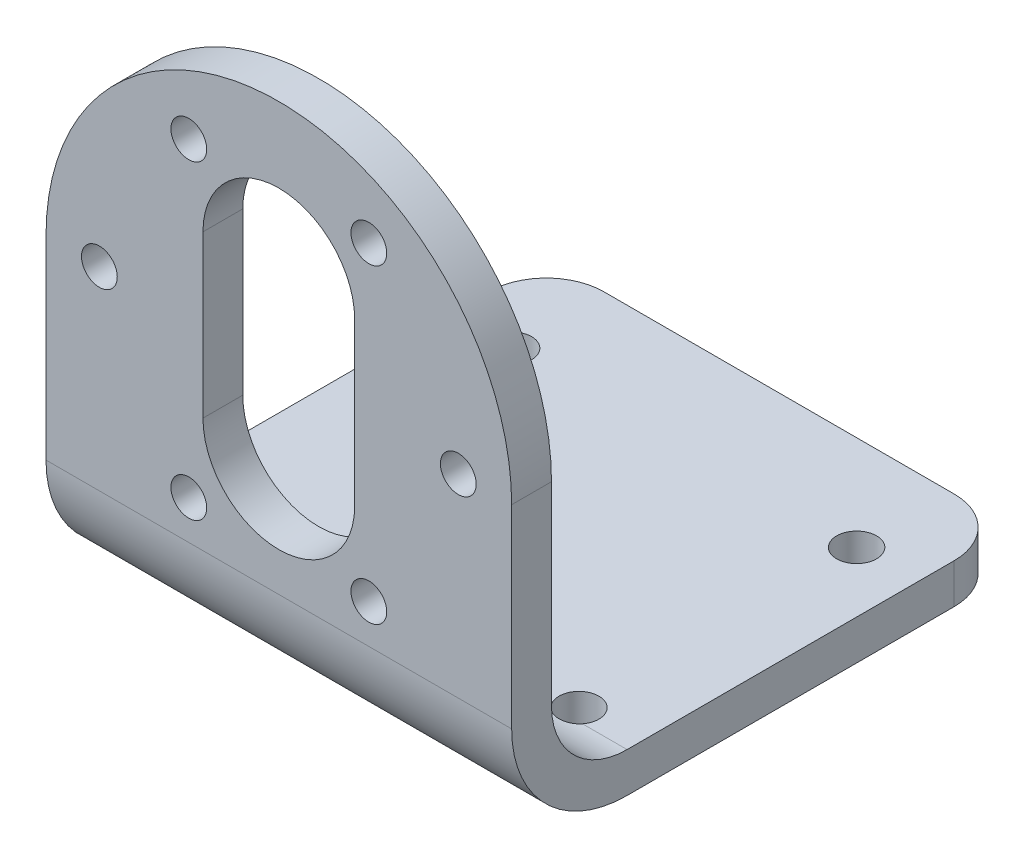
ISO-10303-21;
HEADER;
FILE_DESCRIPTION(('STEP AP214'),'2;1');
FILE_NAME('part.step','',(''),(''),'','','');
FILE_SCHEMA(('AUTOMOTIVE_DESIGN { 1 0 10303 214 1 1 1 1 }'));
ENDSEC;
DATA;
#1=APPLICATION_CONTEXT('core data for automotive mechanical design processes');
#2=APPLICATION_PROTOCOL_DEFINITION('international standard','automotive_design',2000,#1);
#3=PRODUCT_CONTEXT('',#1,'mechanical');
#4=PRODUCT('Part','Part','',(#3));
#5=PRODUCT_RELATED_PRODUCT_CATEGORY('part','',(#4));
#6=PRODUCT_DEFINITION_FORMATION('','',#4);
#7=PRODUCT_DEFINITION_CONTEXT('part definition',#1,'design');
#8=PRODUCT_DEFINITION('design','',#6,#7);
#9=PRODUCT_DEFINITION_SHAPE('','',#8);
#10=(LENGTH_UNIT() NAMED_UNIT(*) SI_UNIT(.MILLI.,.METRE.));
#11=(NAMED_UNIT(*) PLANE_ANGLE_UNIT() SI_UNIT($,.RADIAN.));
#12=(NAMED_UNIT(*) SI_UNIT($,.STERADIAN.) SOLID_ANGLE_UNIT());
#13=UNCERTAINTY_MEASURE_WITH_UNIT(LENGTH_MEASURE(1.E-05),#10,'distance_accuracy_value','');
#14=(GEOMETRIC_REPRESENTATION_CONTEXT(3) GLOBAL_UNCERTAINTY_ASSIGNED_CONTEXT((#13)) GLOBAL_UNIT_ASSIGNED_CONTEXT((#10,
#11,#12)) REPRESENTATION_CONTEXT('',''));
#15=CARTESIAN_POINT('',(0.,0.,0.));
#16=DIRECTION('',(0.,0.,1.));
#17=DIRECTION('',(1.,0.,0.));
#18=AXIS2_PLACEMENT_3D('',#15,#16,#17);
#19=CARTESIAN_POINT('',(-47.1412127925836,47.,50.783023222912));
#20=DIRECTION('',(0.,0.,-1.));
#21=DIRECTION('',(-1.,0.,0.));
#22=AXIS2_PLACEMENT_3D('',#19,#20,#21);
#23=PLANE('',#22);
#24=CARTESIAN_POINT('',(-19.1662127925836,13.3727697016443,50.783023222912));
#25=DIRECTION('',(0.,0.,1.));
#26=DIRECTION('',(1.,0.,0.));
#27=AXIS2_PLACEMENT_3D('',#24,#25,#26);
#28=CIRCLE('',#27,1.55);
#29=CARTESIAN_POINT('',(-17.6162127925836,13.3727697016443,50.783023222912));
#30=VERTEX_POINT('',#29);
#31=EDGE_CURVE('E434',#30,#30,#28,.F.);
#32=ORIENTED_EDGE('',*,*,#31,.T.);
#33=EDGE_LOOP('',(#32));
#34=FACE_BOUND('',#33,.T.);
#35=CARTESIAN_POINT('',(-42.5162127925836,26.825,50.783023222912));
#36=DIRECTION('',(0.,0.,1.));
#37=DIRECTION('',(1.,0.,0.));
#38=AXIS2_PLACEMENT_3D('',#35,#36,#37);
#39=CIRCLE('',#38,1.54999999999999);
#40=CARTESIAN_POINT('',(-40.9662127925836,26.825,50.783023222912));
#41=VERTEX_POINT('',#40);
#42=EDGE_CURVE('E431',#41,#41,#39,.T.);
#43=ORIENTED_EDGE('',*,*,#42,.F.);
#44=EDGE_LOOP('',(#43));
#45=FACE_BOUND('',#44,.T.);
#46=CARTESIAN_POINT('',(-19.1662127925836,40.2772302983557,50.783023222912));
#47=DIRECTION('',(0.,0.,1.));
#48=DIRECTION('',(1.,0.,0.));
#49=AXIS2_PLACEMENT_3D('',#46,#47,#48);
#50=CIRCLE('',#49,1.55);
#51=CARTESIAN_POINT('',(-17.6162127925836,40.2772302983557,50.783023222912));
#52=VERTEX_POINT('',#51);
#53=EDGE_CURVE('E426',#52,#52,#50,.T.);
#54=ORIENTED_EDGE('',*,*,#53,.F.);
#55=EDGE_LOOP('',(#54));
#56=FACE_BOUND('',#55,.T.);
#57=CARTESIAN_POINT('',(-34.7662127925836,13.3727697016443,50.783023222912));
#58=DIRECTION('',(0.,0.,1.));
#59=DIRECTION('',(1.,0.,0.));
#60=AXIS2_PLACEMENT_3D('',#57,#58,#59);
#61=CIRCLE('',#60,1.55);
#62=CARTESIAN_POINT('',(-33.2162127925836,13.3727697016443,50.783023222912));
#63=VERTEX_POINT('',#62);
#64=EDGE_CURVE('E264',#63,#63,#61,.F.);
#65=ORIENTED_EDGE('',*,*,#64,.T.);
#66=EDGE_LOOP('',(#65));
#67=FACE_BOUND('',#66,.T.);
#68=CARTESIAN_POINT('',(-26.9662127925836,19.945,50.783023222912));
#69=DIRECTION('',(0.,0.,1.));
#70=DIRECTION('',(1.,0.,0.));
#71=AXIS2_PLACEMENT_3D('',#68,#69,#70);
#72=CIRCLE('',#71,6.575);
#73=CARTESIAN_POINT('',(-33.5412127925836,19.945,50.783023222912));
#74=VERTEX_POINT('',#73);
#75=CARTESIAN_POINT('',(-20.3912127925836,19.945,50.783023222912));
#76=VERTEX_POINT('',#75);
#77=EDGE_CURVE('E171',#74,#76,#72,.T.);
#78=ORIENTED_EDGE('',*,*,#77,.F.);
#79=DIRECTION('',(0.,-1.,0.));
#80=VECTOR('',#79,1.);
#81=CARTESIAN_POINT('',(-33.5412127925836,0.,50.783023222912));
#82=LINE('',#81,#80);
#83=CARTESIAN_POINT('',(-33.5412127925836,33.925,50.783023222912));
#84=VERTEX_POINT('',#83);
#85=EDGE_CURVE('E49',#84,#74,#82,.T.);
#86=ORIENTED_EDGE('',*,*,#85,.F.);
#87=CARTESIAN_POINT('',(-26.9662127925836,33.925,50.783023222912));
#88=DIRECTION('',(0.,0.,1.));
#89=DIRECTION('',(1.,0.,0.));
#90=AXIS2_PLACEMENT_3D('',#87,#88,#89);
#91=CIRCLE('',#90,6.57500000000001);
#92=CARTESIAN_POINT('',(-20.3912127925836,33.925,50.783023222912));
#93=VERTEX_POINT('',#92);
#94=EDGE_CURVE('E177',#93,#84,#91,.T.);
#95=ORIENTED_EDGE('',*,*,#94,.F.);
#96=DIRECTION('',(0.,-1.,0.));
#97=VECTOR('',#96,1.);
#98=CARTESIAN_POINT('',(-20.3912127925836,0.,50.783023222912));
#99=LINE('',#98,#97);
#100=EDGE_CURVE('E162',#93,#76,#99,.T.);
#101=ORIENTED_EDGE('',*,*,#100,.T.);
#102=EDGE_LOOP('',(#78,#86,#95,#101));
#103=FACE_BOUND('',#102,.T.);
#104=DIRECTION('',(0.,-1.,0.));
#105=VECTOR('',#104,1.);
#106=CARTESIAN_POINT('',(-47.1412127925836,47.,50.783023222912));
#107=LINE('',#106,#105);
#108=CARTESIAN_POINT('',(-47.1412127925836,26.825,50.783023222912));
#109=VERTEX_POINT('',#108);
#110=CARTESIAN_POINT('',(-47.1412127925836,10.,50.783023222912));
#111=VERTEX_POINT('',#110);
#112=EDGE_CURVE('E322',#109,#111,#107,.T.);
#113=ORIENTED_EDGE('',*,*,#112,.T.);
#114=DIRECTION('',(1.,0.,0.));
#115=VECTOR('',#114,1.);
#116=CARTESIAN_POINT('',(-47.1412127925836,10.,50.783023222912));
#117=LINE('',#116,#115);
#118=CARTESIAN_POINT('',(-6.79121279258359,10.,50.783023222912));
#119=VERTEX_POINT('',#118);
#120=EDGE_CURVE('E317',#111,#119,#117,.T.);
#121=ORIENTED_EDGE('',*,*,#120,.T.);
#122=DIRECTION('',(0.,-1.,0.));
#123=VECTOR('',#122,1.);
#124=CARTESIAN_POINT('',(-6.79121279258359,47.,50.783023222912));
#125=LINE('',#124,#123);
#126=CARTESIAN_POINT('',(-6.79121279258359,26.825,50.783023222912));
#127=VERTEX_POINT('',#126);
#128=EDGE_CURVE('E325',#127,#119,#125,.T.);
#129=ORIENTED_EDGE('',*,*,#128,.F.);
#130=CARTESIAN_POINT('',(-26.9662127925836,26.825,50.783023222912));
#131=DIRECTION('',(0.,0.,1.));
#132=DIRECTION('',(1.,0.,0.));
#133=AXIS2_PLACEMENT_3D('',#130,#131,#132);
#134=CIRCLE('',#133,20.175);
#135=EDGE_CURVE('E339',#127,#109,#134,.T.);
#136=ORIENTED_EDGE('',*,*,#135,.T.);
#137=EDGE_LOOP('',(#113,#121,#129,#136));
#138=FACE_BOUND('',#137,.T.);
#139=CARTESIAN_POINT('',(-34.7662127925836,40.2772302983557,50.783023222912));
#140=DIRECTION('',(0.,0.,1.));
#141=DIRECTION('',(1.,0.,0.));
#142=AXIS2_PLACEMENT_3D('',#139,#140,#141);
#143=CIRCLE('',#142,1.55);
#144=CARTESIAN_POINT('',(-33.2162127925836,40.2772302983557,50.783023222912));
#145=VERTEX_POINT('',#144);
#146=EDGE_CURVE('E428',#145,#145,#143,.T.);
#147=ORIENTED_EDGE('',*,*,#146,.F.);
#148=EDGE_LOOP('',(#147));
#149=FACE_BOUND('',#148,.T.);
#150=CARTESIAN_POINT('',(-11.4162127925836,26.825,50.783023222912));
#151=DIRECTION('',(0.,0.,1.));
#152=DIRECTION('',(1.,0.,0.));
#153=AXIS2_PLACEMENT_3D('',#150,#151,#152);
#154=CIRCLE('',#153,1.55);
#155=CARTESIAN_POINT('',(-9.8662127925836,26.825,50.783023222912));
#156=VERTEX_POINT('',#155);
#157=EDGE_CURVE('E437',#156,#156,#154,.T.);
#158=ORIENTED_EDGE('',*,*,#157,.F.);
#159=EDGE_LOOP('',(#158));
#160=FACE_BOUND('',#159,.T.);
#161=ADVANCED_FACE('F32',(#34,#45,#56,#67,#103,#138,#149,#160),#23,.F.);
#162=CARTESIAN_POINT('',(54.8587872074164,0.,47.3330232229119));
#163=DIRECTION('',(0.,0.,1.));
#164=DIRECTION('',(1.,0.,0.));
#165=AXIS2_PLACEMENT_3D('',#162,#163,#164);
#166=PLANE('',#165);
#167=CARTESIAN_POINT('',(-19.1662127925836,13.3727697016443,47.333023222912));
#168=DIRECTION('',(0.,0.,1.));
#169=DIRECTION('',(1.,0.,0.));
#170=AXIS2_PLACEMENT_3D('',#167,#168,#169);
#171=CIRCLE('',#170,1.55);
#172=CARTESIAN_POINT('',(-17.6162127925836,13.3727697016443,47.333023222912));
#173=VERTEX_POINT('',#172);
#174=EDGE_CURVE('E36',#173,#173,#171,.F.);
#175=ORIENTED_EDGE('',*,*,#174,.F.);
#176=EDGE_LOOP('',(#175));
#177=FACE_BOUND('',#176,.T.);
#178=CARTESIAN_POINT('',(-42.5162127925836,26.825,47.333023222912));
#179=DIRECTION('',(0.,0.,1.));
#180=DIRECTION('',(1.,0.,0.));
#181=AXIS2_PLACEMENT_3D('',#178,#179,#180);
#182=CIRCLE('',#181,1.54999999999999);
#183=CARTESIAN_POINT('',(-40.9662127925836,26.825,47.333023222912));
#184=VERTEX_POINT('',#183);
#185=EDGE_CURVE('E237',#184,#184,#182,.T.);
#186=ORIENTED_EDGE('',*,*,#185,.T.);
#187=EDGE_LOOP('',(#186));
#188=FACE_BOUND('',#187,.T.);
#189=CARTESIAN_POINT('',(-19.1662127925836,40.2772302983557,47.333023222912));
#190=DIRECTION('',(0.,0.,1.));
#191=DIRECTION('',(1.,0.,0.));
#192=AXIS2_PLACEMENT_3D('',#189,#190,#191);
#193=CIRCLE('',#192,1.55);
#194=CARTESIAN_POINT('',(-17.6162127925836,40.2772302983557,47.333023222912));
#195=VERTEX_POINT('',#194);
#196=EDGE_CURVE('E241',#195,#195,#193,.T.);
#197=ORIENTED_EDGE('',*,*,#196,.T.);
#198=EDGE_LOOP('',(#197));
#199=FACE_BOUND('',#198,.T.);
#200=CARTESIAN_POINT('',(-34.7662127925836,13.3727697016443,47.333023222912));
#201=DIRECTION('',(0.,0.,1.));
#202=DIRECTION('',(1.,0.,0.));
#203=AXIS2_PLACEMENT_3D('',#200,#201,#202);
#204=CIRCLE('',#203,1.55);
#205=CARTESIAN_POINT('',(-33.2162127925836,13.3727697016443,47.333023222912));
#206=VERTEX_POINT('',#205);
#207=EDGE_CURVE('E245',#206,#206,#204,.F.);
#208=ORIENTED_EDGE('',*,*,#207,.F.);
#209=EDGE_LOOP('',(#208));
#210=FACE_BOUND('',#209,.T.);
#211=CARTESIAN_POINT('',(-26.9662127925836,33.925,47.333023222912));
#212=DIRECTION('',(0.,0.,1.));
#213=DIRECTION('',(1.,0.,0.));
#214=AXIS2_PLACEMENT_3D('',#211,#212,#213);
#215=CIRCLE('',#214,6.57500000000001);
#216=CARTESIAN_POINT('',(-20.3912127925836,33.925,47.333023222912));
#217=VERTEX_POINT('',#216);
#218=CARTESIAN_POINT('',(-33.5412127925836,33.925,47.333023222912));
#219=VERTEX_POINT('',#218);
#220=EDGE_CURVE('E41',#217,#219,#215,.T.);
#221=ORIENTED_EDGE('',*,*,#220,.T.);
#222=DIRECTION('',(0.,-1.,0.));
#223=VECTOR('',#222,1.);
#224=CARTESIAN_POINT('',(-33.5412127925836,0.,47.333023222912));
#225=LINE('',#224,#223);
#226=CARTESIAN_POINT('',(-33.5412127925836,19.945,47.333023222912));
#227=VERTEX_POINT('',#226);
#228=EDGE_CURVE('E11',#219,#227,#225,.T.);
#229=ORIENTED_EDGE('',*,*,#228,.T.);
#230=CARTESIAN_POINT('',(-26.9662127925836,19.945,47.333023222912));
#231=DIRECTION('',(0.,0.,1.));
#232=DIRECTION('',(1.,0.,0.));
#233=AXIS2_PLACEMENT_3D('',#230,#231,#232);
#234=CIRCLE('',#233,6.575);
#235=CARTESIAN_POINT('',(-20.3912127925836,19.945,47.333023222912));
#236=VERTEX_POINT('',#235);
#237=EDGE_CURVE('E268',#227,#236,#234,.T.);
#238=ORIENTED_EDGE('',*,*,#237,.T.);
#239=DIRECTION('',(0.,-1.,0.));
#240=VECTOR('',#239,1.);
#241=CARTESIAN_POINT('',(-20.3912127925836,0.,47.333023222912));
#242=LINE('',#241,#240);
#243=EDGE_CURVE('E165',#217,#236,#242,.T.);
#244=ORIENTED_EDGE('',*,*,#243,.F.);
#245=EDGE_LOOP('',(#221,#229,#238,#244));
#246=FACE_BOUND('',#245,.T.);
#247=DIRECTION('',(-1.,0.,0.));
#248=VECTOR('',#247,1.);
#249=CARTESIAN_POINT('',(54.8587872074164,10.,47.3330232229119));
#250=LINE('',#249,#248);
#251=CARTESIAN_POINT('',(-6.79121279258359,10.,47.333023222912));
#252=VERTEX_POINT('',#251);
#253=CARTESIAN_POINT('',(-47.1412127925836,10.,47.333023222912));
#254=VERTEX_POINT('',#253);
#255=EDGE_CURVE('E250',#252,#254,#250,.T.);
#256=ORIENTED_EDGE('',*,*,#255,.T.);
#257=DIRECTION('',(0.,1.,0.));
#258=VECTOR('',#257,1.);
#259=CARTESIAN_POINT('',(-47.1412127925836,0.,47.333023222912));
#260=LINE('',#259,#258);
#261=CARTESIAN_POINT('',(-47.1412127925836,26.825,47.333023222912));
#262=VERTEX_POINT('',#261);
#263=EDGE_CURVE('E357',#254,#262,#260,.T.);
#264=ORIENTED_EDGE('',*,*,#263,.T.);
#265=CARTESIAN_POINT('',(-26.9662127925836,26.825,47.333023222912));
#266=DIRECTION('',(0.,0.,1.));
#267=DIRECTION('',(1.,0.,0.));
#268=AXIS2_PLACEMENT_3D('',#265,#266,#267);
#269=CIRCLE('',#268,20.175);
#270=CARTESIAN_POINT('',(-6.79121279258359,26.825,47.333023222912));
#271=VERTEX_POINT('',#270);
#272=EDGE_CURVE('E306',#262,#271,#269,.F.);
#273=ORIENTED_EDGE('',*,*,#272,.T.);
#274=DIRECTION('',(0.,1.,0.));
#275=VECTOR('',#274,1.);
#276=CARTESIAN_POINT('',(-6.7912127925836,47.,47.333023222912));
#277=LINE('',#276,#275);
#278=EDGE_CURVE('E345',#252,#271,#277,.T.);
#279=ORIENTED_EDGE('',*,*,#278,.F.);
#280=EDGE_LOOP('',(#256,#264,#273,#279));
#281=FACE_BOUND('',#280,.T.);
#282=CARTESIAN_POINT('',(-34.7662127925836,40.2772302983557,47.333023222912));
#283=DIRECTION('',(0.,0.,1.));
#284=DIRECTION('',(1.,0.,0.));
#285=AXIS2_PLACEMENT_3D('',#282,#283,#284);
#286=CIRCLE('',#285,1.55);
#287=CARTESIAN_POINT('',(-33.2162127925836,40.2772302983557,47.333023222912));
#288=VERTEX_POINT('',#287);
#289=EDGE_CURVE('E255',#288,#288,#286,.T.);
#290=ORIENTED_EDGE('',*,*,#289,.T.);
#291=EDGE_LOOP('',(#290));
#292=FACE_BOUND('',#291,.T.);
#293=CARTESIAN_POINT('',(-11.4162127925836,26.825,47.333023222912));
#294=DIRECTION('',(0.,0.,1.));
#295=DIRECTION('',(1.,0.,0.));
#296=AXIS2_PLACEMENT_3D('',#293,#294,#295);
#297=CIRCLE('',#296,1.55);
#298=CARTESIAN_POINT('',(-9.8662127925836,26.825,47.333023222912));
#299=VERTEX_POINT('',#298);
#300=EDGE_CURVE('E258',#299,#299,#297,.T.);
#301=ORIENTED_EDGE('',*,*,#300,.T.);
#302=EDGE_LOOP('',(#301));
#303=FACE_BOUND('',#302,.T.);
#304=ADVANCED_FACE('F220',(#177,#188,#199,#210,#246,#281,#292,#303),#166,.F.);
#305=CARTESIAN_POINT('',(-47.1412127925836,10.,40.783023222912));
#306=DIRECTION('',(1.,0.,0.));
#307=DIRECTION('',(0.,0.,-1.));
#308=AXIS2_PLACEMENT_3D('',#305,#306,#307);
#309=CYLINDRICAL_SURFACE('',#308,10.);
#310=DIRECTION('',(1.,0.,0.));
#311=VECTOR('',#310,1.);
#312=CARTESIAN_POINT('',(0.,0.,40.783023222912));
#313=LINE('',#312,#311);
#314=CARTESIAN_POINT('',(-43.2784362563963,0.,40.783023222912));
#315=VERTEX_POINT('',#314);
#316=CARTESIAN_POINT('',(-47.1412127925836,0.,40.783023222912));
#317=VERTEX_POINT('',#316);
#318=EDGE_CURVE('E314',#315,#317,#313,.F.);
#319=ORIENTED_EDGE('',*,*,#318,.F.);
#320=CARTESIAN_POINT('',(-43.2784362563963,0.,40.783023222912));
#321=CARTESIAN_POINT('',(-43.2486359399709,-4.4349836473621E-07,40.8214603242163));
#322=CARTESIAN_POINT('',(-43.2172287872784,0.000221662332903279,40.8586212397988));
#323=CARTESIAN_POINT('',(-43.1514043101819,0.0010186956629008,40.9301644796071));
#324=CARTESIAN_POINT('',(-43.1169872222953,0.00159359546079015,40.9645470217466));
#325=CARTESIAN_POINT('',(-43.0096338534374,0.00370689110784972,41.0630910128974));
#326=CARTESIAN_POINT('',(-42.9324984911893,0.0056344754400285,41.1227736432645));
#327=CARTESIAN_POINT('',(-42.7693296609276,0.00977993356184888,41.228345263273));
#328=CARTESIAN_POINT('',(-42.6832930344563,0.0119979104668324,41.2742293340198));
#329=CARTESIAN_POINT('',(-42.5047417406216,0.0160643864272017,41.3509225745123));
#330=CARTESIAN_POINT('',(-42.4122283105362,0.017912955792662,41.3817346145671));
#331=CARTESIAN_POINT('',(-42.2232265987625,0.0207581801391745,41.4274329016619));
#332=CARTESIAN_POINT('',(-42.12673395157,0.0217538719032161,41.4423011469684));
#333=CARTESIAN_POINT('',(-41.9326057116994,0.0226429764720122,41.4556247462691));
#334=CARTESIAN_POINT('',(-41.8349700052027,0.0225362785590523,41.4540784516805));
#335=CARTESIAN_POINT('',(-41.6415763854825,0.021247958445125,41.4346366721685));
#336=CARTESIAN_POINT('',(-41.545814678288,0.0200688027684255,41.4167787017401));
#337=CARTESIAN_POINT('',(-41.3586275956189,0.0169319205563948,41.3652693387677));
#338=CARTESIAN_POINT('',(-41.2672030897992,0.0149740386105347,41.3316147934571));
#339=CARTESIAN_POINT('',(-41.0911541003926,0.0107972095030289,41.24941231941));
#340=CARTESIAN_POINT('',(-41.0065411024623,0.0085778363148311,41.2008398734209));
#341=CARTESIAN_POINT('',(-40.8467183970987,0.00456685197800229,41.0901995387781));
#342=CARTESIAN_POINT('',(-40.7714972938275,0.0027747199777472,41.0281482605263));
#343=CARTESIAN_POINT('',(-40.6737041799865,0.00108006920567029,40.9325906426761));
#344=CARTESIAN_POINT('',(-40.6463021380582,0.000686824269006335,40.9039027447807));
#345=CARTESIAN_POINT('',(-40.5935784639084,0.000146949433395791,40.8447642573952));
#346=CARTESIAN_POINT('',(-40.5682532244093,-1.17077590246397E-07,40.8143168878988));
#347=CARTESIAN_POINT('',(-40.5439893287709,0.,40.783023222912));
#348=B_SPLINE_CURVE_WITH_KNOTS('',3,(#320,#321,#322,#323,#324,#325,#326,#327,#328,#329,#330,
#331,#332,#333,#334,#335,#336,#337,#338,#339,#340,#341,#342,#343,#344,#345,#346,#347),
.UNSPECIFIED.,.F.,.F.,(4,2,2,2,2,2,2,2,2,2,2,2,2,4),(0.,0.145817200628919,0.291622953380003,
0.5827663273497,0.874013365077776,1.1652049162671,1.45672489938087,1.74827416137905,
2.03915458593045,2.33009309068699,2.62151232879096,2.91257445855667,3.03152037022583,
3.1502550998775),.UNSPECIFIED.);
#349=CARTESIAN_POINT('',(-40.5439893287709,0.,40.783023222912));
#350=VERTEX_POINT('',#349);
#351=EDGE_CURVE('E363',#315,#350,#348,.T.);
#352=ORIENTED_EDGE('',*,*,#351,.T.);
#353=CARTESIAN_POINT('',(-13.3884362563963,0.,40.783023222912));
#354=VERTEX_POINT('',#353);
#355=EDGE_CURVE('E313',#354,#350,#313,.F.);
#356=ORIENTED_EDGE('',*,*,#355,.F.);
#357=CARTESIAN_POINT('',(-13.3884362563963,0.,40.783023222912));
#358=CARTESIAN_POINT('',(-13.3586359399709,-4.43498364004496E-07,40.8214603242163));
#359=CARTESIAN_POINT('',(-13.3272287872784,0.000221662332904452,40.8586212397988));
#360=CARTESIAN_POINT('',(-13.261404310182,0.0010186956629024,40.9301644796071));
#361=CARTESIAN_POINT('',(-13.2269872222954,0.00159359546079172,40.9645470217466));
#362=CARTESIAN_POINT('',(-13.1196338534375,0.00370689110785085,41.0630910128974));
#363=CARTESIAN_POINT('',(-13.0424984911893,0.00563447544002885,41.1227736432645));
#364=CARTESIAN_POINT('',(-12.8793296609276,0.00977993356184872,41.228345263273));
#365=CARTESIAN_POINT('',(-12.7932930344563,0.0119979104668325,41.2742293340198));
#366=CARTESIAN_POINT('',(-12.6147417406216,0.016064386427203,41.3509225745122));
#367=CARTESIAN_POINT('',(-12.5222283105362,0.0179129557926641,41.3817346145671));
#368=CARTESIAN_POINT('',(-12.3332265987625,0.0207581801391763,41.4274329016619));
#369=CARTESIAN_POINT('',(-12.23673395157,0.0217538719032167,41.4423011469684));
#370=CARTESIAN_POINT('',(-12.0426057116995,0.0226429764720127,41.4556247462691));
#371=CARTESIAN_POINT('',(-11.9449700052027,0.022536278559054,41.4540784516805));
#372=CARTESIAN_POINT('',(-11.7515763854825,0.0212479584451273,41.4346366721685));
#373=CARTESIAN_POINT('',(-11.655814678288,0.0200688027684272,41.4167787017401));
#374=CARTESIAN_POINT('',(-11.4686275956189,0.0169319205563954,41.3652693387677));
#375=CARTESIAN_POINT('',(-11.3772030897992,0.0149740386105346,41.3316147934571));
#376=CARTESIAN_POINT('',(-11.2011541003926,0.0107972095030294,41.24941231941));
#377=CARTESIAN_POINT('',(-11.1165411024623,0.00857783631483298,41.2008398734209));
#378=CARTESIAN_POINT('',(-10.9567183970987,0.00456685197800412,41.0901995387781));
#379=CARTESIAN_POINT('',(-10.8814972938275,0.00277471997774761,41.0281482605263));
#380=CARTESIAN_POINT('',(-10.7837041799865,0.00108006920567024,40.9325906426761));
#381=CARTESIAN_POINT('',(-10.7563021380582,0.00068682426900633,40.9039027447807));
#382=CARTESIAN_POINT('',(-10.7035784639084,0.000146949433395858,40.8447642573952));
#383=CARTESIAN_POINT('',(-10.6782532244093,-1.17077590163831E-07,40.8143168878988));
#384=CARTESIAN_POINT('',(-10.6539893287709,0.,40.783023222912));
#385=B_SPLINE_CURVE_WITH_KNOTS('',3,(#357,#358,#359,#360,#361,#362,#363,#364,#365,#366,#367,
#368,#369,#370,#371,#372,#373,#374,#375,#376,#377,#378,#379,#380,#381,#382,#383,#384),
.UNSPECIFIED.,.F.,.F.,(4,2,2,2,2,2,2,2,2,2,2,2,2,4),(0.,0.145817200628917,0.29162295337999,
0.582766327349691,0.874013365077768,1.16520491626709,1.45672489938085,1.74827416137904,
2.03915458593043,2.33009309068698,2.62151232879094,2.91257445855666,3.03152037022582,
3.1502550998775),.UNSPECIFIED.);
#386=CARTESIAN_POINT('',(-10.6539893287709,0.,40.783023222912));
#387=VERTEX_POINT('',#386);
#388=EDGE_CURVE('E194',#354,#387,#385,.T.);
#389=ORIENTED_EDGE('',*,*,#388,.T.);
#390=CARTESIAN_POINT('',(-6.7912127925836,0.,40.783023222912));
#391=VERTEX_POINT('',#390);
#392=EDGE_CURVE('E310',#391,#387,#313,.F.);
#393=ORIENTED_EDGE('',*,*,#392,.F.);
#394=CARTESIAN_POINT('',(-6.79121279258359,10.,40.783023222912));
#395=DIRECTION('',(-1.,0.,0.));
#396=DIRECTION('',(0.,0.,1.));
#397=AXIS2_PLACEMENT_3D('',#394,#395,#396);
#398=CIRCLE('',#397,10.);
#399=EDGE_CURVE('E315',#119,#391,#398,.F.);
#400=ORIENTED_EDGE('',*,*,#399,.F.);
#401=ORIENTED_EDGE('',*,*,#120,.F.);
#402=CARTESIAN_POINT('',(-47.1412127925836,10.,40.783023222912));
#403=DIRECTION('',(1.,0.,0.));
#404=DIRECTION('',(0.,0.,-1.));
#405=AXIS2_PLACEMENT_3D('',#402,#403,#404);
#406=CIRCLE('',#405,10.);
#407=EDGE_CURVE('E308',#317,#111,#406,.F.);
#408=ORIENTED_EDGE('',*,*,#407,.F.);
#409=EDGE_LOOP('',(#319,#352,#356,#389,#393,#400,#401,#408));
#410=FACE_BOUND('',#409,.T.);
#411=ADVANCED_FACE('F222',(#410),#309,.T.);
#412=CARTESIAN_POINT('',(54.8587872074164,10.,40.783023222912));
#413=DIRECTION('',(-1.,0.,0.));
#414=DIRECTION('',(0.,0.,1.));
#415=AXIS2_PLACEMENT_3D('',#412,#413,#414);
#416=CYLINDRICAL_SURFACE('',#415,6.55);
#417=CARTESIAN_POINT('',(-43.2784362563963,3.45,40.783023222912));
#418=CARTESIAN_POINT('',(-43.2486649030444,3.44999934867349,40.8214232101327));
#419=CARTESIAN_POINT('',(-43.2172902209575,3.45033775649313,40.8585485309627));
#420=CARTESIAN_POINT('',(-43.1515404880796,3.45155234711172,40.9300223959799));
#421=CARTESIAN_POINT('',(-43.1171657950523,3.4524284658614,40.9643712703312));
#422=CARTESIAN_POINT('',(-43.0099569119221,3.4556495514347,41.0628179147159));
#423=CARTESIAN_POINT('',(-42.9329391434865,3.45858816576504,41.1224428225017));
#424=CARTESIAN_POINT('',(-42.7700443143619,3.46491250386588,41.2279283458496));
#425=CARTESIAN_POINT('',(-42.6841653050849,3.46829832602347,41.2737859252697));
#426=CARTESIAN_POINT('',(-42.5059278443798,3.47451325501785,41.3504810031661));
#427=CARTESIAN_POINT('',(-42.4135705615224,3.47734246191005,41.3813212025926));
#428=CARTESIAN_POINT('',(-42.2247208263061,3.48170828002287,41.4271593411075));
#429=CARTESIAN_POINT('',(-42.1282182748401,3.48324152138179,41.4421160044016));
#430=CARTESIAN_POINT('',(-41.9340504787137,3.48461989976377,41.4556076068657));
#431=CARTESIAN_POINT('',(-41.8363851496024,3.48446491341682,41.4541413459035));
#432=CARTESIAN_POINT('',(-41.6432092488083,3.48251007467015,41.4348786711695));
#433=CARTESIAN_POINT('',(-41.5476901567274,3.48071871713345,41.4171665920683));
#434=CARTESIAN_POINT('',(-41.360958528036,3.47594847703818,41.3660360946161));
#435=CARTESIAN_POINT('',(-41.2697470123892,3.47296931451527,41.3326139730928));
#436=CARTESIAN_POINT('',(-41.0939340886157,3.4666029712209,41.2508939730243));
#437=CARTESIAN_POINT('',(-41.0093543826965,3.46321453608974,41.2025496178487));
#438=CARTESIAN_POINT('',(-40.8495367810102,3.45707866045226,41.0923795263331));
#439=CARTESIAN_POINT('',(-40.7742873177906,3.45433042244906,41.0305707505484));
#440=CARTESIAN_POINT('',(-40.6759167088539,3.45169993130762,40.9348709782518));
#441=CARTESIAN_POINT('',(-40.6480286032222,3.45108135877871,40.9057707295625));
#442=CARTESIAN_POINT('',(-40.5943938538111,3.45023162529874,40.8457439712088));
#443=CARTESIAN_POINT('',(-40.5686436235682,3.44999980253179,40.814820675295));
#444=CARTESIAN_POINT('',(-40.5439893287709,3.45,40.783023222912));
#445=B_SPLINE_CURVE_WITH_KNOTS('',3,(#417,#418,#419,#420,#421,#422,#423,#424,#425,#426,#427,
#428,#429,#430,#431,#432,#433,#434,#435,#436,#437,#438,#439,#440,#441,#442,#443,#444),
.UNSPECIFIED.,.F.,.F.,(4,2,2,2,2,2,2,2,2,2,2,2,2,4),(0.,0.145674126204746,0.291330903847856,
0.582167706488014,0.873068601032213,1.16391715626718,1.45551969013826,1.74714353348516,
2.03726202612376,2.32744893983427,2.61854894557612,2.90928436386592,3.03013527599317,
3.15077917208322),.UNSPECIFIED.);
#446=CARTESIAN_POINT('',(-43.2784362563963,3.44999999999999,40.783023222912));
#447=VERTEX_POINT('',#446);
#448=CARTESIAN_POINT('',(-40.5439893287709,3.44999999999999,40.783023222912));
#449=VERTEX_POINT('',#448);
#450=EDGE_CURVE('E370',#447,#449,#445,.T.);
#451=ORIENTED_EDGE('',*,*,#450,.F.);
#452=DIRECTION('',(-1.,0.,0.));
#453=VECTOR('',#452,1.);
#454=CARTESIAN_POINT('',(54.8587872074164,3.45,40.783023222912));
#455=LINE('',#454,#453);
#456=CARTESIAN_POINT('',(-47.1412127925836,3.45,40.783023222912));
#457=VERTEX_POINT('',#456);
#458=EDGE_CURVE('E350',#447,#457,#455,.T.);
#459=ORIENTED_EDGE('',*,*,#458,.T.);
#460=CARTESIAN_POINT('',(-47.1412127925836,10.,40.783023222912));
#461=DIRECTION('',(-1.,0.,0.));
#462=DIRECTION('',(0.,0.,1.));
#463=AXIS2_PLACEMENT_3D('',#460,#461,#462);
#464=CIRCLE('',#463,6.55);
#465=EDGE_CURVE('E359',#457,#254,#464,.T.);
#466=ORIENTED_EDGE('',*,*,#465,.T.);
#467=ORIENTED_EDGE('',*,*,#255,.F.);
#468=CARTESIAN_POINT('',(-6.79121279258359,10.,40.783023222912));
#469=DIRECTION('',(-1.,0.,0.));
#470=DIRECTION('',(0.,0.,1.));
#471=AXIS2_PLACEMENT_3D('',#468,#469,#470);
#472=CIRCLE('',#471,6.55);
#473=CARTESIAN_POINT('',(-6.7912127925836,3.45,40.783023222912));
#474=VERTEX_POINT('',#473);
#475=EDGE_CURVE('E303',#474,#252,#472,.T.);
#476=ORIENTED_EDGE('',*,*,#475,.F.);
#477=CARTESIAN_POINT('',(-10.6539893287709,3.44999999999999,40.783023222912));
#478=VERTEX_POINT('',#477);
#479=EDGE_CURVE('E348',#474,#478,#455,.T.);
#480=ORIENTED_EDGE('',*,*,#479,.T.);
#481=CARTESIAN_POINT('',(-13.3884362563963,3.45,40.783023222912));
#482=CARTESIAN_POINT('',(-13.3586649030444,3.44999934867349,40.8214232101327));
#483=CARTESIAN_POINT('',(-13.3272902209575,3.45033775649313,40.8585485309627));
#484=CARTESIAN_POINT('',(-13.2615404880797,3.45155234711172,40.9300223959798));
#485=CARTESIAN_POINT('',(-13.2271657950523,3.4524284658614,40.9643712703311));
#486=CARTESIAN_POINT('',(-13.1199569119221,3.4556495514347,41.0628179147159));
#487=CARTESIAN_POINT('',(-13.0429391434865,3.45858816576504,41.1224428225017));
#488=CARTESIAN_POINT('',(-12.8800443143619,3.46491250386588,41.2279283458496));
#489=CARTESIAN_POINT('',(-12.7941653050849,3.46829832602347,41.2737859252697));
#490=CARTESIAN_POINT('',(-12.6159278443798,3.47451325501785,41.3504810031661));
#491=CARTESIAN_POINT('',(-12.5235705615224,3.47734246191005,41.3813212025926));
#492=CARTESIAN_POINT('',(-12.3347208263061,3.48170828002287,41.4271593411075));
#493=CARTESIAN_POINT('',(-12.2382182748401,3.48324152138179,41.4421160044016));
#494=CARTESIAN_POINT('',(-12.0440504787137,3.48461989976377,41.4556076068657));
#495=CARTESIAN_POINT('',(-11.9463851496024,3.48446491341683,41.4541413459035));
#496=CARTESIAN_POINT('',(-11.7532092488083,3.48251007467015,41.4348786711695));
#497=CARTESIAN_POINT('',(-11.6576901567275,3.48071871713346,41.4171665920683));
#498=CARTESIAN_POINT('',(-11.470958528036,3.47594847703818,41.3660360946161));
#499=CARTESIAN_POINT('',(-11.3797470123892,3.47296931451527,41.3326139730928));
#500=CARTESIAN_POINT('',(-11.2039340886157,3.4666029712209,41.2508939730243));
#501=CARTESIAN_POINT('',(-11.1193543826966,3.46321453608974,41.2025496178487));
#502=CARTESIAN_POINT('',(-10.9595367810102,3.45707866045226,41.0923795263331));
#503=CARTESIAN_POINT('',(-10.8842873177906,3.45433042244906,41.0305707505484));
#504=CARTESIAN_POINT('',(-10.7859167088539,3.45169993130762,40.9348709782518));
#505=CARTESIAN_POINT('',(-10.7580286032222,3.45108135877871,40.9057707295625));
#506=CARTESIAN_POINT('',(-10.7043938538111,3.45023162529874,40.8457439712088));
#507=CARTESIAN_POINT('',(-10.6786436235682,3.44999980253179,40.814820675295));
#508=CARTESIAN_POINT('',(-10.6539893287709,3.45,40.783023222912));
#509=B_SPLINE_CURVE_WITH_KNOTS('',3,(#481,#482,#483,#484,#485,#486,#487,#488,#489,#490,#491,
#492,#493,#494,#495,#496,#497,#498,#499,#500,#501,#502,#503,#504,#505,#506,#507,#508),
.UNSPECIFIED.,.F.,.F.,(4,2,2,2,2,2,2,2,2,2,2,2,2,4),(0.,0.145674126204736,0.291330903847846,
0.58216770648801,0.8730686010322,1.16391715626717,1.45551969013825,1.74714353348516,
2.03726202612376,2.32744893983427,2.61854894557612,2.90928436386591,3.03013527599317,
3.15077917208322),.UNSPECIFIED.);
#510=CARTESIAN_POINT('',(-13.3884362563963,3.44999999999999,40.783023222912));
#511=VERTEX_POINT('',#510);
#512=EDGE_CURVE('E184',#511,#478,#509,.T.);
#513=ORIENTED_EDGE('',*,*,#512,.F.);
#514=EDGE_CURVE('E354',#511,#449,#455,.T.);
#515=ORIENTED_EDGE('',*,*,#514,.T.);
#516=EDGE_LOOP('',(#451,#459,#466,#467,#476,#480,#513,#515));
#517=FACE_BOUND('',#516,.T.);
#518=ADVANCED_FACE('F201',(#517),#416,.F.);
#519=CARTESIAN_POINT('',(-47.1412127925836,47.,7.43302322291196));
#520=DIRECTION('',(0.,0.,1.));
#521=DIRECTION('',(1.,0.,0.));
#522=AXIS2_PLACEMENT_3D('',#519,#520,#521);
#523=PLANE('',#522);
#524=DIRECTION('',(1.,0.,0.));
#525=VECTOR('',#524,1.);
#526=CARTESIAN_POINT('',(-47.1412127925836,3.45,7.43302322291196));
#527=LINE('',#526,#525);
#528=CARTESIAN_POINT('',(-42.1412127925836,3.45,7.43302322291196));
#529=VERTEX_POINT('',#528);
#530=CARTESIAN_POINT('',(-11.7912127925836,3.45,7.43302322291196));
#531=VERTEX_POINT('',#530);
#532=EDGE_CURVE('E342',#529,#531,#527,.T.);
#533=ORIENTED_EDGE('',*,*,#532,.T.);
#534=DIRECTION('',(0.,-1.,0.));
#535=VECTOR('',#534,1.);
#536=CARTESIAN_POINT('',(-11.7912127925836,47.,7.43302322291196));
#537=LINE('',#536,#535);
#538=CARTESIAN_POINT('',(-11.7912127925836,0.,7.43302322291196));
#539=VERTEX_POINT('',#538);
#540=EDGE_CURVE('E296',#531,#539,#537,.T.);
#541=ORIENTED_EDGE('',*,*,#540,.T.);
#542=DIRECTION('',(-1.,0.,0.));
#543=VECTOR('',#542,1.);
#544=CARTESIAN_POINT('',(-47.1412127925836,0.,7.43302322291196));
#545=LINE('',#544,#543);
#546=CARTESIAN_POINT('',(-42.1412127925836,0.,7.43302322291196));
#547=VERTEX_POINT('',#546);
#548=EDGE_CURVE('E328',#539,#547,#545,.T.);
#549=ORIENTED_EDGE('',*,*,#548,.T.);
#550=DIRECTION('',(0.,-1.,0.));
#551=VECTOR('',#550,1.);
#552=CARTESIAN_POINT('',(-42.1412127925836,47.,7.43302322291196));
#553=LINE('',#552,#551);
#554=EDGE_CURVE('E299',#547,#529,#553,.F.);
#555=ORIENTED_EDGE('',*,*,#554,.T.);
#556=EDGE_LOOP('',(#533,#541,#549,#555));
#557=FACE_BOUND('',#556,.T.);
#558=ADVANCED_FACE('F557',(#557),#523,.F.);
#559=CARTESIAN_POINT('',(-47.1412127925836,47.,7.43302322291196));
#560=DIRECTION('',(1.,0.,0.));
#561=DIRECTION('',(0.,0.,-1.));
#562=AXIS2_PLACEMENT_3D('',#559,#560,#561);
#563=PLANE('',#562);
#564=DIRECTION('',(0.,0.,1.));
#565=VECTOR('',#564,1.);
#566=CARTESIAN_POINT('',(-47.1412127925836,3.45,0.));
#567=LINE('',#566,#565);
#568=CARTESIAN_POINT('',(-47.1412127925836,3.45,12.433023222912));
#569=VERTEX_POINT('',#568);
#570=EDGE_CURVE('E351',#569,#457,#567,.T.);
#571=ORIENTED_EDGE('',*,*,#570,.F.);
#572=DIRECTION('',(0.,-1.,0.));
#573=VECTOR('',#572,1.);
#574=CARTESIAN_POINT('',(-47.1412127925836,47.,12.433023222912));
#575=LINE('',#574,#573);
#576=CARTESIAN_POINT('',(-47.1412127925836,0.,12.433023222912));
#577=VERTEX_POINT('',#576);
#578=EDGE_CURVE('E283',#569,#577,#575,.T.);
#579=ORIENTED_EDGE('',*,*,#578,.T.);
#580=DIRECTION('',(0.,0.,1.));
#581=VECTOR('',#580,1.);
#582=CARTESIAN_POINT('',(-47.1412127925836,0.,7.43302322291196));
#583=LINE('',#582,#581);
#584=EDGE_CURVE('E334',#577,#317,#583,.T.);
#585=ORIENTED_EDGE('',*,*,#584,.T.);
#586=ORIENTED_EDGE('',*,*,#407,.T.);
#587=ORIENTED_EDGE('',*,*,#112,.F.);
#588=DIRECTION('',(0.,0.,1.));
#589=VECTOR('',#588,1.);
#590=CARTESIAN_POINT('',(-47.1412127925836,26.825,-51.216976777088));
#591=LINE('',#590,#589);
#592=EDGE_CURVE('E337',#262,#109,#591,.T.);
#593=ORIENTED_EDGE('',*,*,#592,.F.);
#594=ORIENTED_EDGE('',*,*,#263,.F.);
#595=ORIENTED_EDGE('',*,*,#465,.F.);
#596=EDGE_LOOP('',(#571,#579,#585,#586,#587,#593,#594,#595));
#597=FACE_BOUND('',#596,.T.);
#598=ADVANCED_FACE('F611',(#597),#563,.F.);
#599=CARTESIAN_POINT('',(-6.7912127925836,47.,7.43302322291196));
#600=DIRECTION('',(-1.,0.,0.));
#601=DIRECTION('',(0.,0.,1.));
#602=AXIS2_PLACEMENT_3D('',#599,#600,#601);
#603=PLANE('',#602);
#604=DIRECTION('',(0.,0.,-1.));
#605=VECTOR('',#604,1.);
#606=CARTESIAN_POINT('',(-6.7912127925836,0.,7.43302322291196));
#607=LINE('',#606,#605);
#608=CARTESIAN_POINT('',(-6.7912127925836,0.,12.433023222912));
#609=VERTEX_POINT('',#608);
#610=EDGE_CURVE('E331',#391,#609,#607,.T.);
#611=ORIENTED_EDGE('',*,*,#610,.T.);
#612=DIRECTION('',(0.,-1.,0.));
#613=VECTOR('',#612,1.);
#614=CARTESIAN_POINT('',(-6.7912127925836,47.,12.433023222912));
#615=LINE('',#614,#613);
#616=CARTESIAN_POINT('',(-6.7912127925836,3.45,12.433023222912));
#617=VERTEX_POINT('',#616);
#618=EDGE_CURVE('E290',#609,#617,#615,.F.);
#619=ORIENTED_EDGE('',*,*,#618,.T.);
#620=DIRECTION('',(0.,0.,1.));
#621=VECTOR('',#620,1.);
#622=CARTESIAN_POINT('',(-6.7912127925836,3.45,7.43302322291196));
#623=LINE('',#622,#621);
#624=EDGE_CURVE('E301',#617,#474,#623,.T.);
#625=ORIENTED_EDGE('',*,*,#624,.T.);
#626=ORIENTED_EDGE('',*,*,#475,.T.);
#627=ORIENTED_EDGE('',*,*,#278,.T.);
#628=DIRECTION('',(0.,0.,1.));
#629=VECTOR('',#628,1.);
#630=CARTESIAN_POINT('',(-6.7912127925836,26.825,-51.216976777088));
#631=LINE('',#630,#629);
#632=EDGE_CURVE('E320',#271,#127,#631,.T.);
#633=ORIENTED_EDGE('',*,*,#632,.T.);
#634=ORIENTED_EDGE('',*,*,#128,.T.);
#635=ORIENTED_EDGE('',*,*,#399,.T.);
#636=EDGE_LOOP('',(#611,#619,#625,#626,#627,#633,#634,#635));
#637=FACE_BOUND('',#636,.T.);
#638=ADVANCED_FACE('F588',(#637),#603,.F.);
#639=CARTESIAN_POINT('',(0.,0.,0.));
#640=DIRECTION('',(0.,1.,0.));
#641=DIRECTION('',(0.,0.,1.));
#642=AXIS2_PLACEMENT_3D('',#639,#640,#641);
#643=PLANE('',#642);
#644=CARTESIAN_POINT('',(-41.9112127925836,0.,39.723023222912));
#645=DIRECTION('',(0.,1.,0.));
#646=DIRECTION('',(0.,0.,1.));
#647=AXIS2_PLACEMENT_3D('',#644,#645,#646);
#648=CIRCLE('',#647,1.73);
#649=EDGE_CURVE('E361',#315,#350,#648,.F.);
#650=ORIENTED_EDGE('',*,*,#649,.F.);
#651=ORIENTED_EDGE('',*,*,#318,.T.);
#652=ORIENTED_EDGE('',*,*,#584,.F.);
#653=CARTESIAN_POINT('',(-42.1412127925836,0.,12.433023222912));
#654=DIRECTION('',(0.,1.,0.));
#655=DIRECTION('',(0.,0.,1.));
#656=AXIS2_PLACEMENT_3D('',#653,#654,#655);
#657=CIRCLE('',#656,5.);
#658=EDGE_CURVE('E294',#577,#547,#657,.F.);
#659=ORIENTED_EDGE('',*,*,#658,.T.);
#660=ORIENTED_EDGE('',*,*,#548,.F.);
#661=CARTESIAN_POINT('',(-11.7912127925836,0.,12.433023222912));
#662=DIRECTION('',(0.,1.,0.));
#663=DIRECTION('',(0.,0.,1.));
#664=AXIS2_PLACEMENT_3D('',#661,#662,#663);
#665=CIRCLE('',#664,5.);
#666=EDGE_CURVE('E292',#539,#609,#665,.F.);
#667=ORIENTED_EDGE('',*,*,#666,.T.);
#668=ORIENTED_EDGE('',*,*,#610,.F.);
#669=ORIENTED_EDGE('',*,*,#392,.T.);
#670=CARTESIAN_POINT('',(-12.0212127925836,0.,39.723023222912));
#671=DIRECTION('',(0.,1.,0.));
#672=DIRECTION('',(0.,0.,1.));
#673=AXIS2_PLACEMENT_3D('',#670,#671,#672);
#674=CIRCLE('',#673,1.73);
#675=EDGE_CURVE('E281',#354,#387,#674,.F.);
#676=ORIENTED_EDGE('',*,*,#675,.F.);
#677=ORIENTED_EDGE('',*,*,#355,.T.);
#678=EDGE_LOOP('',(#650,#651,#652,#659,#660,#667,#668,#669,#676,#677));
#679=FACE_BOUND('',#678,.T.);
#680=CARTESIAN_POINT('',(-12.0212127925836,0.,15.663023222912));
#681=DIRECTION('',(0.,1.,0.));
#682=DIRECTION('',(0.,0.,1.));
#683=AXIS2_PLACEMENT_3D('',#680,#681,#682);
#684=CIRCLE('',#683,1.73);
#685=CARTESIAN_POINT('',(-12.0212127925836,0.,17.393023222912));
#686=VERTEX_POINT('',#685);
#687=EDGE_CURVE('E276',#686,#686,#684,.F.);
#688=ORIENTED_EDGE('',*,*,#687,.F.);
#689=EDGE_LOOP('',(#688));
#690=FACE_BOUND('',#689,.T.);
#691=CARTESIAN_POINT('',(-41.9112127925836,0.,15.663023222912));
#692=DIRECTION('',(0.,1.,0.));
#693=DIRECTION('',(0.,0.,1.));
#694=AXIS2_PLACEMENT_3D('',#691,#692,#693);
#695=CIRCLE('',#694,1.73);
#696=CARTESIAN_POINT('',(-41.9112127925836,0.,17.393023222912));
#697=VERTEX_POINT('',#696);
#698=EDGE_CURVE('E277',#697,#697,#695,.F.);
#699=ORIENTED_EDGE('',*,*,#698,.F.);
#700=EDGE_LOOP('',(#699));
#701=FACE_BOUND('',#700,.T.);
#702=ADVANCED_FACE('F584',(#679,#690,#701),#643,.F.);
#703=CARTESIAN_POINT('',(-26.9662127925836,26.825,-51.216976777088));
#704=DIRECTION('',(0.,0.,1.));
#705=DIRECTION('',(1.,0.,0.));
#706=AXIS2_PLACEMENT_3D('',#703,#704,#705);
#707=CYLINDRICAL_SURFACE('',#706,20.175);
#708=ORIENTED_EDGE('',*,*,#272,.F.);
#709=ORIENTED_EDGE('',*,*,#592,.T.);
#710=ORIENTED_EDGE('',*,*,#135,.F.);
#711=ORIENTED_EDGE('',*,*,#632,.F.);
#712=EDGE_LOOP('',(#708,#709,#710,#711));
#713=FACE_BOUND('',#712,.T.);
#714=ADVANCED_FACE('F218',(#713),#707,.T.);
#715=CARTESIAN_POINT('',(54.8587872074164,3.45,0.));
#716=DIRECTION('',(0.,-1.,0.));
#717=DIRECTION('',(0.,0.,-1.));
#718=AXIS2_PLACEMENT_3D('',#715,#716,#717);
#719=PLANE('',#718);
#720=CARTESIAN_POINT('',(-41.9112127925836,3.44999999999999,39.723023222912));
#721=DIRECTION('',(0.,-1.,0.));
#722=DIRECTION('',(0.,0.,-1.));
#723=AXIS2_PLACEMENT_3D('',#720,#721,#722);
#724=CIRCLE('',#723,1.73);
#725=EDGE_CURVE('E270',#449,#447,#724,.F.);
#726=ORIENTED_EDGE('',*,*,#725,.F.);
#727=ORIENTED_EDGE('',*,*,#514,.F.);
#728=CARTESIAN_POINT('',(-12.0212127925836,3.44999999999999,39.723023222912));
#729=DIRECTION('',(0.,-1.,0.));
#730=DIRECTION('',(0.,0.,-1.));
#731=AXIS2_PLACEMENT_3D('',#728,#729,#730);
#732=CIRCLE('',#731,1.73);
#733=EDGE_CURVE('E272',#478,#511,#732,.F.);
#734=ORIENTED_EDGE('',*,*,#733,.F.);
#735=ORIENTED_EDGE('',*,*,#479,.F.);
#736=ORIENTED_EDGE('',*,*,#624,.F.);
#737=CARTESIAN_POINT('',(-11.7912127925836,3.45,12.433023222912));
#738=DIRECTION('',(0.,-1.,0.));
#739=DIRECTION('',(0.,0.,-1.));
#740=AXIS2_PLACEMENT_3D('',#737,#738,#739);
#741=CIRCLE('',#740,5.);
#742=EDGE_CURVE('E286',#617,#531,#741,.F.);
#743=ORIENTED_EDGE('',*,*,#742,.T.);
#744=ORIENTED_EDGE('',*,*,#532,.F.);
#745=CARTESIAN_POINT('',(-42.1412127925836,3.45,12.433023222912));
#746=DIRECTION('',(0.,-1.,0.));
#747=DIRECTION('',(0.,0.,-1.));
#748=AXIS2_PLACEMENT_3D('',#745,#746,#747);
#749=CIRCLE('',#748,5.);
#750=EDGE_CURVE('E288',#529,#569,#749,.F.);
#751=ORIENTED_EDGE('',*,*,#750,.T.);
#752=ORIENTED_EDGE('',*,*,#570,.T.);
#753=ORIENTED_EDGE('',*,*,#458,.F.);
#754=EDGE_LOOP('',(#726,#727,#734,#735,#736,#743,#744,#751,#752,#753));
#755=FACE_BOUND('',#754,.T.);
#756=CARTESIAN_POINT('',(-12.0212127925836,3.44999999999999,15.663023222912));
#757=DIRECTION('',(0.,-1.,0.));
#758=DIRECTION('',(0.,0.,-1.));
#759=AXIS2_PLACEMENT_3D('',#756,#757,#758);
#760=CIRCLE('',#759,1.73);
#761=CARTESIAN_POINT('',(-12.0212127925836,3.44999999999999,13.933023222912));
#762=VERTEX_POINT('',#761);
#763=EDGE_CURVE('E273',#762,#762,#760,.F.);
#764=ORIENTED_EDGE('',*,*,#763,.F.);
#765=EDGE_LOOP('',(#764));
#766=FACE_BOUND('',#765,.T.);
#767=CARTESIAN_POINT('',(-41.9112127925836,3.44999999999999,15.663023222912));
#768=DIRECTION('',(0.,-1.,0.));
#769=DIRECTION('',(0.,0.,-1.));
#770=AXIS2_PLACEMENT_3D('',#767,#768,#769);
#771=CIRCLE('',#770,1.73);
#772=CARTESIAN_POINT('',(-41.9112127925836,3.44999999999999,13.933023222912));
#773=VERTEX_POINT('',#772);
#774=EDGE_CURVE('E278',#773,#773,#771,.F.);
#775=ORIENTED_EDGE('',*,*,#774,.F.);
#776=EDGE_LOOP('',(#775));
#777=FACE_BOUND('',#776,.T.);
#778=ADVANCED_FACE('F214',(#755,#766,#777),#719,.F.);
#779=CARTESIAN_POINT('',(-11.7912127925836,47.,12.433023222912));
#780=DIRECTION('',(0.,-1.,0.));
#781=DIRECTION('',(0.,0.,-1.));
#782=AXIS2_PLACEMENT_3D('',#779,#780,#781);
#783=CYLINDRICAL_SURFACE('',#782,5.);
#784=ORIENTED_EDGE('',*,*,#742,.F.);
#785=ORIENTED_EDGE('',*,*,#618,.F.);
#786=ORIENTED_EDGE('',*,*,#666,.F.);
#787=ORIENTED_EDGE('',*,*,#540,.F.);
#788=EDGE_LOOP('',(#784,#785,#786,#787));
#789=FACE_BOUND('',#788,.T.);
#790=ADVANCED_FACE('F217',(#789),#783,.T.);
#791=CARTESIAN_POINT('',(-42.1412127925836,47.,12.433023222912));
#792=DIRECTION('',(0.,-1.,0.));
#793=DIRECTION('',(0.,0.,-1.));
#794=AXIS2_PLACEMENT_3D('',#791,#792,#793);
#795=CYLINDRICAL_SURFACE('',#794,5.);
#796=ORIENTED_EDGE('',*,*,#750,.F.);
#797=ORIENTED_EDGE('',*,*,#554,.F.);
#798=ORIENTED_EDGE('',*,*,#658,.F.);
#799=ORIENTED_EDGE('',*,*,#578,.F.);
#800=EDGE_LOOP('',(#796,#797,#798,#799));
#801=FACE_BOUND('',#800,.T.);
#802=ADVANCED_FACE('F34',(#801),#795,.T.);
#803=CARTESIAN_POINT('',(-12.0212127925836,105.45,39.723023222912));
#804=DIRECTION('',(0.,-1.,0.));
#805=DIRECTION('',(0.,0.,-1.));
#806=AXIS2_PLACEMENT_3D('',#803,#804,#805);
#807=CYLINDRICAL_SURFACE('',#806,1.73);
#808=ORIENTED_EDGE('',*,*,#512,.T.);
#809=ORIENTED_EDGE('',*,*,#733,.T.);
#810=EDGE_LOOP('',(#808,#809));
#811=FACE_BOUND('',#810,.T.);
#812=ORIENTED_EDGE('',*,*,#675,.T.);
#813=ORIENTED_EDGE('',*,*,#388,.F.);
#814=EDGE_LOOP('',(#812,#813));
#815=FACE_BOUND('',#814,.T.);
#816=ADVANCED_FACE('F205',(#811,#815),#807,.F.);
#817=CARTESIAN_POINT('',(-41.9112127925836,105.45,15.663023222912));
#818=DIRECTION('',(0.,-1.,0.));
#819=DIRECTION('',(0.,0.,-1.));
#820=AXIS2_PLACEMENT_3D('',#817,#818,#819);
#821=CYLINDRICAL_SURFACE('',#820,1.73);
#822=ORIENTED_EDGE('',*,*,#774,.T.);
#823=EDGE_LOOP('',(#822));
#824=FACE_BOUND('',#823,.T.);
#825=ORIENTED_EDGE('',*,*,#698,.T.);
#826=EDGE_LOOP('',(#825));
#827=FACE_BOUND('',#826,.T.);
#828=ADVANCED_FACE('F210',(#824,#827),#821,.F.);
#829=CARTESIAN_POINT('',(-12.0212127925836,105.45,15.663023222912));
#830=DIRECTION('',(0.,-1.,0.));
#831=DIRECTION('',(0.,0.,-1.));
#832=AXIS2_PLACEMENT_3D('',#829,#830,#831);
#833=CYLINDRICAL_SURFACE('',#832,1.73);
#834=ORIENTED_EDGE('',*,*,#763,.T.);
#835=EDGE_LOOP('',(#834));
#836=FACE_BOUND('',#835,.T.);
#837=ORIENTED_EDGE('',*,*,#687,.T.);
#838=EDGE_LOOP('',(#837));
#839=FACE_BOUND('',#838,.T.);
#840=ADVANCED_FACE('F212',(#836,#839),#833,.F.);
#841=CARTESIAN_POINT('',(-41.9112127925836,105.45,39.723023222912));
#842=DIRECTION('',(0.,-1.,0.));
#843=DIRECTION('',(0.,0.,-1.));
#844=AXIS2_PLACEMENT_3D('',#841,#842,#843);
#845=CYLINDRICAL_SURFACE('',#844,1.73);
#846=ORIENTED_EDGE('',*,*,#450,.T.);
#847=ORIENTED_EDGE('',*,*,#725,.T.);
#848=EDGE_LOOP('',(#846,#847));
#849=FACE_BOUND('',#848,.T.);
#850=ORIENTED_EDGE('',*,*,#649,.T.);
#851=ORIENTED_EDGE('',*,*,#351,.F.);
#852=EDGE_LOOP('',(#850,#851));
#853=FACE_BOUND('',#852,.T.);
#854=ADVANCED_FACE('F378',(#849,#853),#845,.F.);
#855=CARTESIAN_POINT('',(-33.5412127925836,0.,-51.216976777088));
#856=DIRECTION('',(-1.,0.,0.));
#857=DIRECTION('',(0.,-1.,0.));
#858=AXIS2_PLACEMENT_3D('',#855,#856,#857);
#859=PLANE('',#858);
#860=DIRECTION('',(0.,0.,1.));
#861=VECTOR('',#860,1.);
#862=CARTESIAN_POINT('',(-33.5412127925836,33.925,-51.216976777088));
#863=LINE('',#862,#861);
#864=EDGE_CURVE('E182',#219,#84,#863,.T.);
#865=ORIENTED_EDGE('',*,*,#864,.T.);
#866=ORIENTED_EDGE('',*,*,#85,.T.);
#867=DIRECTION('',(0.,0.,1.));
#868=VECTOR('',#867,1.);
#869=CARTESIAN_POINT('',(-33.5412127925836,19.945,-51.216976777088));
#870=LINE('',#869,#868);
#871=EDGE_CURVE('E168',#227,#74,#870,.T.);
#872=ORIENTED_EDGE('',*,*,#871,.F.);
#873=ORIENTED_EDGE('',*,*,#228,.F.);
#874=EDGE_LOOP('',(#865,#866,#872,#873));
#875=FACE_BOUND('',#874,.T.);
#876=ADVANCED_FACE('F382',(#875),#859,.F.);
#877=CARTESIAN_POINT('',(-26.9662127925836,33.925,-51.216976777088));
#878=DIRECTION('',(0.,0.,1.));
#879=DIRECTION('',(1.,0.,0.));
#880=AXIS2_PLACEMENT_3D('',#877,#878,#879);
#881=CYLINDRICAL_SURFACE('',#880,6.57500000000001);
#882=DIRECTION('',(0.,0.,1.));
#883=VECTOR('',#882,1.);
#884=CARTESIAN_POINT('',(-20.3912127925836,33.925,-51.216976777088));
#885=LINE('',#884,#883);
#886=EDGE_CURVE('E167',#217,#93,#885,.T.);
#887=ORIENTED_EDGE('',*,*,#886,.T.);
#888=ORIENTED_EDGE('',*,*,#94,.T.);
#889=ORIENTED_EDGE('',*,*,#864,.F.);
#890=ORIENTED_EDGE('',*,*,#220,.F.);
#891=EDGE_LOOP('',(#887,#888,#889,#890));
#892=FACE_BOUND('',#891,.T.);
#893=ADVANCED_FACE('F390',(#892),#881,.F.);
#894=CARTESIAN_POINT('',(-20.3912127925836,0.,-51.216976777088));
#895=DIRECTION('',(-1.,0.,0.));
#896=DIRECTION('',(0.,-1.,0.));
#897=AXIS2_PLACEMENT_3D('',#894,#895,#896);
#898=PLANE('',#897);
#899=ORIENTED_EDGE('',*,*,#243,.T.);
#900=DIRECTION('',(0.,0.,1.));
#901=VECTOR('',#900,1.);
#902=CARTESIAN_POINT('',(-20.3912127925836,19.945,-51.216976777088));
#903=LINE('',#902,#901);
#904=EDGE_CURVE('E57',#236,#76,#903,.T.);
#905=ORIENTED_EDGE('',*,*,#904,.T.);
#906=ORIENTED_EDGE('',*,*,#100,.F.);
#907=ORIENTED_EDGE('',*,*,#886,.F.);
#908=EDGE_LOOP('',(#899,#905,#906,#907));
#909=FACE_BOUND('',#908,.T.);
#910=ADVANCED_FACE('F159',(#909),#898,.T.);
#911=CARTESIAN_POINT('',(-26.9662127925836,19.945,-51.216976777088));
#912=DIRECTION('',(0.,0.,1.));
#913=DIRECTION('',(1.,0.,0.));
#914=AXIS2_PLACEMENT_3D('',#911,#912,#913);
#915=CYLINDRICAL_SURFACE('',#914,6.575);
#916=ORIENTED_EDGE('',*,*,#871,.T.);
#917=ORIENTED_EDGE('',*,*,#77,.T.);
#918=ORIENTED_EDGE('',*,*,#904,.F.);
#919=ORIENTED_EDGE('',*,*,#237,.F.);
#920=EDGE_LOOP('',(#916,#917,#918,#919));
#921=FACE_BOUND('',#920,.T.);
#922=ADVANCED_FACE('F172',(#921),#915,.F.);
#923=CARTESIAN_POINT('',(-34.7662127925836,13.3727697016443,-51.216976777088));
#924=DIRECTION('',(0.,0.,1.));
#925=DIRECTION('',(1.,0.,0.));
#926=AXIS2_PLACEMENT_3D('',#923,#924,#925);
#927=CYLINDRICAL_SURFACE('',#926,1.55);
#928=ORIENTED_EDGE('',*,*,#64,.F.);
#929=EDGE_LOOP('',(#928));
#930=FACE_BOUND('',#929,.T.);
#931=ORIENTED_EDGE('',*,*,#207,.T.);
#932=EDGE_LOOP('',(#931));
#933=FACE_BOUND('',#932,.T.);
#934=ADVANCED_FACE('F393',(#930,#933),#927,.F.);
#935=CARTESIAN_POINT('',(-19.1662127925836,40.2772302983557,-51.216976777088));
#936=DIRECTION('',(0.,0.,1.));
#937=DIRECTION('',(1.,0.,0.));
#938=AXIS2_PLACEMENT_3D('',#935,#936,#937);
#939=CYLINDRICAL_SURFACE('',#938,1.55);
#940=ORIENTED_EDGE('',*,*,#53,.T.);
#941=EDGE_LOOP('',(#940));
#942=FACE_BOUND('',#941,.T.);
#943=ORIENTED_EDGE('',*,*,#196,.F.);
#944=EDGE_LOOP('',(#943));
#945=FACE_BOUND('',#944,.T.);
#946=ADVANCED_FACE('F401',(#942,#945),#939,.F.);
#947=CARTESIAN_POINT('',(-34.7662127925836,40.2772302983557,-51.216976777088));
#948=DIRECTION('',(0.,0.,1.));
#949=DIRECTION('',(1.,0.,0.));
#950=AXIS2_PLACEMENT_3D('',#947,#948,#949);
#951=CYLINDRICAL_SURFACE('',#950,1.55);
#952=ORIENTED_EDGE('',*,*,#146,.T.);
#953=EDGE_LOOP('',(#952));
#954=FACE_BOUND('',#953,.T.);
#955=ORIENTED_EDGE('',*,*,#289,.F.);
#956=EDGE_LOOP('',(#955));
#957=FACE_BOUND('',#956,.T.);
#958=ADVANCED_FACE('F403',(#954,#957),#951,.F.);
#959=CARTESIAN_POINT('',(-42.5162127925836,26.825,-51.216976777088));
#960=DIRECTION('',(0.,0.,1.));
#961=DIRECTION('',(1.,0.,0.));
#962=AXIS2_PLACEMENT_3D('',#959,#960,#961);
#963=CYLINDRICAL_SURFACE('',#962,1.54999999999999);
#964=ORIENTED_EDGE('',*,*,#42,.T.);
#965=EDGE_LOOP('',(#964));
#966=FACE_BOUND('',#965,.T.);
#967=ORIENTED_EDGE('',*,*,#185,.F.);
#968=EDGE_LOOP('',(#967));
#969=FACE_BOUND('',#968,.T.);
#970=ADVANCED_FACE('F406',(#966,#969),#963,.F.);
#971=CARTESIAN_POINT('',(-11.4162127925836,26.825,-51.216976777088));
#972=DIRECTION('',(0.,0.,1.));
#973=DIRECTION('',(1.,0.,0.));
#974=AXIS2_PLACEMENT_3D('',#971,#972,#973);
#975=CYLINDRICAL_SURFACE('',#974,1.55);
#976=ORIENTED_EDGE('',*,*,#157,.T.);
#977=EDGE_LOOP('',(#976));
#978=FACE_BOUND('',#977,.T.);
#979=ORIENTED_EDGE('',*,*,#300,.F.);
#980=EDGE_LOOP('',(#979));
#981=FACE_BOUND('',#980,.T.);
#982=ADVANCED_FACE('F410',(#978,#981),#975,.F.);
#983=CARTESIAN_POINT('',(-19.1662127925836,13.3727697016443,-51.216976777088));
#984=DIRECTION('',(0.,0.,1.));
#985=DIRECTION('',(1.,0.,0.));
#986=AXIS2_PLACEMENT_3D('',#983,#984,#985);
#987=CYLINDRICAL_SURFACE('',#986,1.55);
#988=ORIENTED_EDGE('',*,*,#31,.F.);
#989=EDGE_LOOP('',(#988));
#990=FACE_BOUND('',#989,.T.);
#991=ORIENTED_EDGE('',*,*,#174,.T.);
#992=EDGE_LOOP('',(#991));
#993=FACE_BOUND('',#992,.T.);
#994=ADVANCED_FACE('F414',(#990,#993),#987,.F.);
#995=CLOSED_SHELL('',(#161,#304,#411,#518,#558,#598,#638,#702,#714,#778,#790,#802,#816,#828,
#840,#854,#876,#893,#910,#922,#934,#946,#958,#970,#982,#994));
#996=MANIFOLD_SOLID_BREP('B2',#995);
#997=ADVANCED_BREP_SHAPE_REPRESENTATION('',(#18,#996),#14);
#998=SHAPE_DEFINITION_REPRESENTATION(#9,#997);
ENDSEC;
END-ISO-10303-21;
